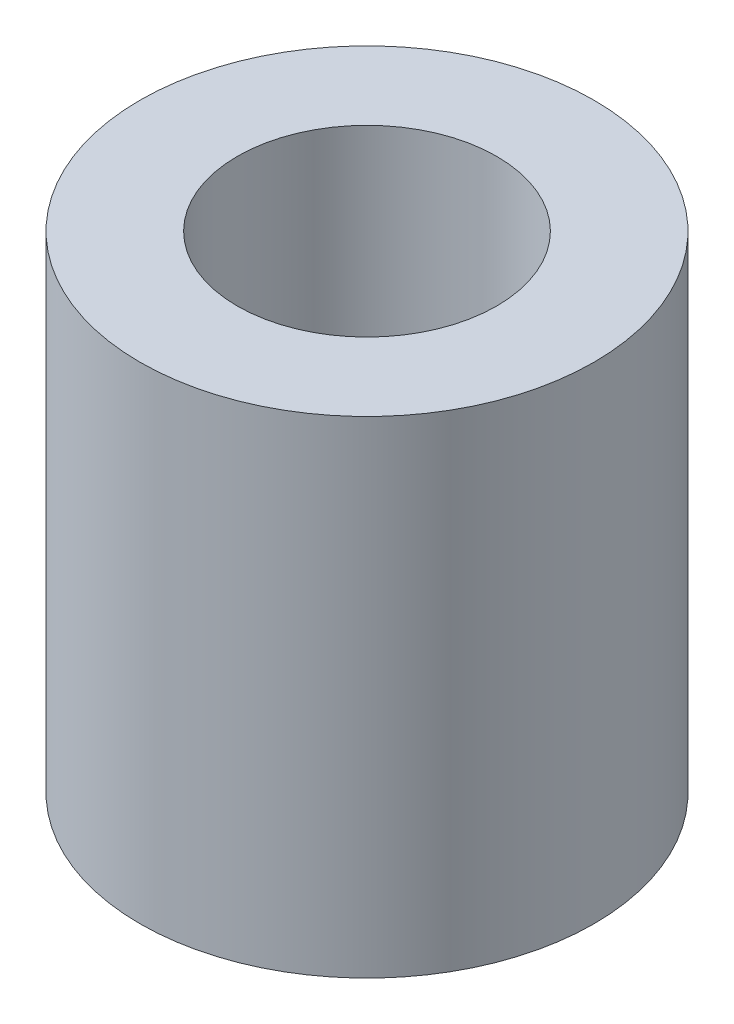
ISO-10303-21;
HEADER;
FILE_DESCRIPTION(('STEP AP214'),'2;1');
FILE_NAME('part.step','',(''),(''),'','','');
FILE_SCHEMA(('AUTOMOTIVE_DESIGN { 1 0 10303 214 1 1 1 1 }'));
ENDSEC;
DATA;
#1=APPLICATION_CONTEXT('core data for automotive mechanical design processes');
#2=APPLICATION_PROTOCOL_DEFINITION('international standard','automotive_design',2000,#1);
#3=PRODUCT_CONTEXT('',#1,'mechanical');
#4=PRODUCT('Part','Part','',(#3));
#5=PRODUCT_RELATED_PRODUCT_CATEGORY('part','',(#4));
#6=PRODUCT_DEFINITION_FORMATION('','',#4);
#7=PRODUCT_DEFINITION_CONTEXT('part definition',#1,'design');
#8=PRODUCT_DEFINITION('design','',#6,#7);
#9=PRODUCT_DEFINITION_SHAPE('','',#8);
#10=(LENGTH_UNIT() NAMED_UNIT(*) SI_UNIT(.MILLI.,.METRE.));
#11=(NAMED_UNIT(*) PLANE_ANGLE_UNIT() SI_UNIT($,.RADIAN.));
#12=(NAMED_UNIT(*) SI_UNIT($,.STERADIAN.) SOLID_ANGLE_UNIT());
#13=UNCERTAINTY_MEASURE_WITH_UNIT(LENGTH_MEASURE(1.E-05),#10,'distance_accuracy_value','');
#14=(GEOMETRIC_REPRESENTATION_CONTEXT(3) GLOBAL_UNCERTAINTY_ASSIGNED_CONTEXT((#13)) GLOBAL_UNIT_ASSIGNED_CONTEXT((#10,
#11,#12)) REPRESENTATION_CONTEXT('',''));
#15=CARTESIAN_POINT('',(0.,0.,0.));
#16=DIRECTION('',(0.,0.,1.));
#17=DIRECTION('',(1.,0.,0.));
#18=AXIS2_PLACEMENT_3D('',#15,#16,#17);
#19=CARTESIAN_POINT('',(0.,9.525,0.));
#20=DIRECTION('',(0.,1.,0.));
#21=DIRECTION('',(0.,0.,1.));
#22=AXIS2_PLACEMENT_3D('',#19,#20,#21);
#23=PLANE('',#22);
#24=CARTESIAN_POINT('',(0.,9.525,0.));
#25=DIRECTION('',(0.,1.,0.));
#26=DIRECTION('',(0.,0.,1.));
#27=AXIS2_PLACEMENT_3D('',#24,#25,#26);
#28=CIRCLE('',#27,4.445);
#29=CARTESIAN_POINT('',(0.,9.525,4.445));
#30=VERTEX_POINT('',#29);
#31=EDGE_CURVE('E10',#30,#30,#28,.T.);
#32=ORIENTED_EDGE('',*,*,#31,.T.);
#33=EDGE_LOOP('',(#32));
#34=FACE_BOUND('',#33,.T.);
#35=CARTESIAN_POINT('',(0.,9.525,0.));
#36=DIRECTION('',(0.,1.,0.));
#37=DIRECTION('',(0.,0.,1.));
#38=AXIS2_PLACEMENT_3D('',#35,#36,#37);
#39=CIRCLE('',#38,2.54);
#40=CARTESIAN_POINT('',(0.,9.525,2.54));
#41=VERTEX_POINT('',#40);
#42=EDGE_CURVE('E41',#41,#41,#39,.T.);
#43=ORIENTED_EDGE('',*,*,#42,.F.);
#44=EDGE_LOOP('',(#43));
#45=FACE_BOUND('',#44,.T.);
#46=ADVANCED_FACE('F30',(#34,#45),#23,.T.);
#47=CARTESIAN_POINT('',(0.,0.,0.));
#48=DIRECTION('',(0.,1.,0.));
#49=DIRECTION('',(0.,0.,1.));
#50=AXIS2_PLACEMENT_3D('',#47,#48,#49);
#51=PLANE('',#50);
#52=CARTESIAN_POINT('',(0.,0.,0.));
#53=DIRECTION('',(0.,1.,0.));
#54=DIRECTION('',(0.,0.,1.));
#55=AXIS2_PLACEMENT_3D('',#52,#53,#54);
#56=CIRCLE('',#55,4.445);
#57=CARTESIAN_POINT('',(0.,0.,4.445));
#58=VERTEX_POINT('',#57);
#59=EDGE_CURVE('E34',#58,#58,#56,.T.);
#60=ORIENTED_EDGE('',*,*,#59,.F.);
#61=EDGE_LOOP('',(#60));
#62=FACE_BOUND('',#61,.T.);
#63=CARTESIAN_POINT('',(0.,0.,0.));
#64=DIRECTION('',(0.,1.,0.));
#65=DIRECTION('',(0.,0.,1.));
#66=AXIS2_PLACEMENT_3D('',#63,#64,#65);
#67=CIRCLE('',#66,2.54);
#68=CARTESIAN_POINT('',(0.,0.,2.54));
#69=VERTEX_POINT('',#68);
#70=EDGE_CURVE('E43',#69,#69,#67,.T.);
#71=ORIENTED_EDGE('',*,*,#70,.T.);
#72=EDGE_LOOP('',(#71));
#73=FACE_BOUND('',#72,.T.);
#74=ADVANCED_FACE('F53',(#62,#73),#51,.F.);
#75=CARTESIAN_POINT('',(0.,9.525,0.));
#76=DIRECTION('',(0.,-1.,0.));
#77=DIRECTION('',(0.,0.,-1.));
#78=AXIS2_PLACEMENT_3D('',#75,#76,#77);
#79=CYLINDRICAL_SURFACE('',#78,4.445);
#80=ORIENTED_EDGE('',*,*,#31,.F.);
#81=EDGE_LOOP('',(#80));
#82=FACE_BOUND('',#81,.T.);
#83=ORIENTED_EDGE('',*,*,#59,.T.);
#84=EDGE_LOOP('',(#83));
#85=FACE_BOUND('',#84,.T.);
#86=ADVANCED_FACE('F32',(#82,#85),#79,.T.);
#87=CARTESIAN_POINT('',(0.,9.525,0.));
#88=DIRECTION('',(0.,-1.,0.));
#89=DIRECTION('',(0.,0.,-1.));
#90=AXIS2_PLACEMENT_3D('',#87,#88,#89);
#91=CYLINDRICAL_SURFACE('',#90,2.54);
#92=ORIENTED_EDGE('',*,*,#42,.T.);
#93=EDGE_LOOP('',(#92));
#94=FACE_BOUND('',#93,.T.);
#95=ORIENTED_EDGE('',*,*,#70,.F.);
#96=EDGE_LOOP('',(#95));
#97=FACE_BOUND('',#96,.T.);
#98=ADVANCED_FACE('F49',(#94,#97),#91,.F.);
#99=CLOSED_SHELL('',(#46,#74,#86,#98));
#100=MANIFOLD_SOLID_BREP('B2',#99);
#101=ADVANCED_BREP_SHAPE_REPRESENTATION('',(#18,#100),#14);
#102=SHAPE_DEFINITION_REPRESENTATION(#9,#101);
ENDSEC;
END-ISO-10303-21;
